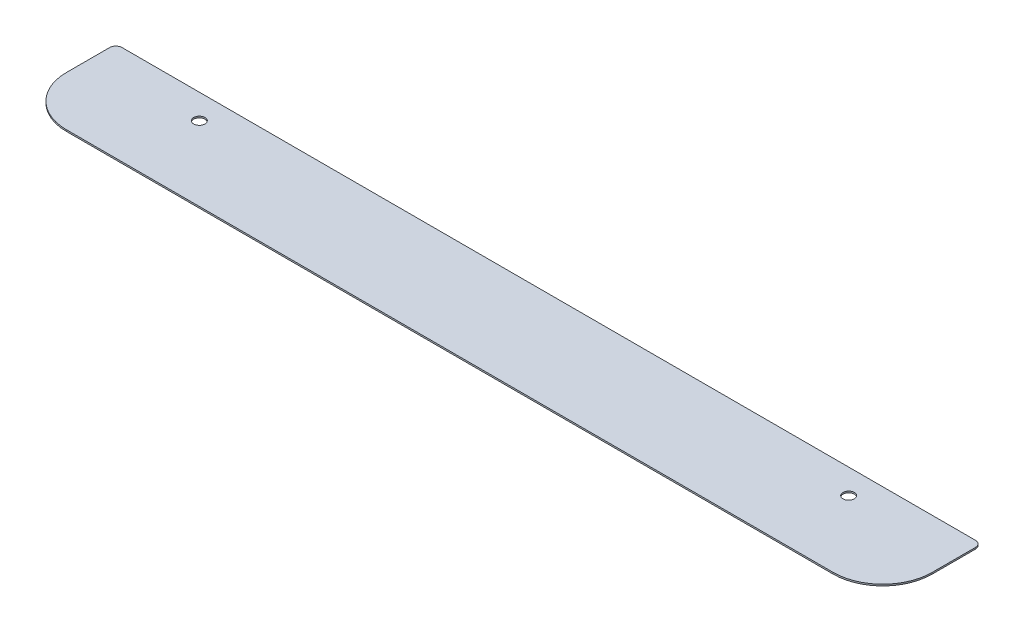
ISO-10303-21;
HEADER;
FILE_DESCRIPTION(('STEP AP214'),'2;1');
FILE_NAME('part.step','',(''),(''),'','','');
FILE_SCHEMA(('AUTOMOTIVE_DESIGN { 1 0 10303 214 1 1 1 1 }'));
ENDSEC;
DATA;
#1=APPLICATION_CONTEXT('core data for automotive mechanical design processes');
#2=APPLICATION_PROTOCOL_DEFINITION('international standard','automotive_design',2000,#1);
#3=PRODUCT_CONTEXT('',#1,'mechanical');
#4=PRODUCT('Part','Part','',(#3));
#5=PRODUCT_RELATED_PRODUCT_CATEGORY('part','',(#4));
#6=PRODUCT_DEFINITION_FORMATION('','',#4);
#7=PRODUCT_DEFINITION_CONTEXT('part definition',#1,'design');
#8=PRODUCT_DEFINITION('design','',#6,#7);
#9=PRODUCT_DEFINITION_SHAPE('','',#8);
#10=(LENGTH_UNIT() NAMED_UNIT(*) SI_UNIT(.MILLI.,.METRE.));
#11=(NAMED_UNIT(*) PLANE_ANGLE_UNIT() SI_UNIT($,.RADIAN.));
#12=(NAMED_UNIT(*) SI_UNIT($,.STERADIAN.) SOLID_ANGLE_UNIT());
#13=UNCERTAINTY_MEASURE_WITH_UNIT(LENGTH_MEASURE(1.E-05),#10,'distance_accuracy_value','');
#14=(GEOMETRIC_REPRESENTATION_CONTEXT(3) GLOBAL_UNCERTAINTY_ASSIGNED_CONTEXT((#13)) GLOBAL_UNIT_ASSIGNED_CONTEXT((#10,
#11,#12)) REPRESENTATION_CONTEXT('',''));
#15=CARTESIAN_POINT('',(0.,0.,0.));
#16=DIRECTION('',(0.,0.,1.));
#17=DIRECTION('',(1.,0.,0.));
#18=AXIS2_PLACEMENT_3D('',#15,#16,#17);
#19=CARTESIAN_POINT('',(222.25,0.79375,25.4));
#20=DIRECTION('',(-1.,0.,0.));
#21=DIRECTION('',(0.,0.,1.));
#22=AXIS2_PLACEMENT_3D('',#19,#20,#21);
#23=PLANE('',#22);
#24=DIRECTION('',(0.,0.,-1.));
#25=VECTOR('',#24,1.);
#26=CARTESIAN_POINT('',(222.25,0.,25.4));
#27=LINE('',#26,#25);
#28=CARTESIAN_POINT('',(222.25,0.,0.));
#29=VERTEX_POINT('',#28);
#30=CARTESIAN_POINT('',(222.25,0.,-22.225));
#31=VERTEX_POINT('',#30);
#32=EDGE_CURVE('E116',#29,#31,#27,.T.);
#33=ORIENTED_EDGE('',*,*,#32,.T.);
#34=DIRECTION('',(0.,-1.,0.));
#35=VECTOR('',#34,1.);
#36=CARTESIAN_POINT('',(222.25,0.79375,-22.225));
#37=LINE('',#36,#35);
#38=CARTESIAN_POINT('',(222.25,0.79375,-22.225));
#39=VERTEX_POINT('',#38);
#40=EDGE_CURVE('E11',#31,#39,#37,.F.);
#41=ORIENTED_EDGE('',*,*,#40,.T.);
#42=DIRECTION('',(0.,0.,-1.));
#43=VECTOR('',#42,1.);
#44=CARTESIAN_POINT('',(222.25,0.79375,25.4));
#45=LINE('',#44,#43);
#46=CARTESIAN_POINT('',(222.25,0.79375,0.));
#47=VERTEX_POINT('',#46);
#48=EDGE_CURVE('E117',#47,#39,#45,.T.);
#49=ORIENTED_EDGE('',*,*,#48,.F.);
#50=DIRECTION('',(0.,-1.,0.));
#51=VECTOR('',#50,1.);
#52=CARTESIAN_POINT('',(222.25,0.79375,0.));
#53=LINE('',#52,#51);
#54=EDGE_CURVE('E107',#47,#29,#53,.T.);
#55=ORIENTED_EDGE('',*,*,#54,.T.);
#56=EDGE_LOOP('',(#33,#41,#49,#55));
#57=FACE_BOUND('',#56,.T.);
#58=ADVANCED_FACE('F36',(#57),#23,.F.);
#59=CARTESIAN_POINT('',(-222.25,0.79375,-25.4));
#60=DIRECTION('',(0.,0.,1.));
#61=DIRECTION('',(1.,0.,0.));
#62=AXIS2_PLACEMENT_3D('',#59,#60,#61);
#63=PLANE('',#62);
#64=DIRECTION('',(-1.,0.,0.));
#65=VECTOR('',#64,1.);
#66=CARTESIAN_POINT('',(-222.25,0.,-25.4));
#67=LINE('',#66,#65);
#68=CARTESIAN_POINT('',(219.075,0.,-25.4));
#69=VERTEX_POINT('',#68);
#70=CARTESIAN_POINT('',(-219.075,0.,-25.4));
#71=VERTEX_POINT('',#70);
#72=EDGE_CURVE('E124',#69,#71,#67,.T.);
#73=ORIENTED_EDGE('',*,*,#72,.T.);
#74=DIRECTION('',(0.,-1.,0.));
#75=VECTOR('',#74,1.);
#76=CARTESIAN_POINT('',(-219.075,0.79375,-25.4));
#77=LINE('',#76,#75);
#78=CARTESIAN_POINT('',(-219.075,0.79375,-25.4));
#79=VERTEX_POINT('',#78);
#80=EDGE_CURVE('E57',#71,#79,#77,.F.);
#81=ORIENTED_EDGE('',*,*,#80,.T.);
#82=DIRECTION('',(-1.,0.,0.));
#83=VECTOR('',#82,1.);
#84=CARTESIAN_POINT('',(-222.25,0.79375,-25.4));
#85=LINE('',#84,#83);
#86=CARTESIAN_POINT('',(219.075,0.79375,-25.4));
#87=VERTEX_POINT('',#86);
#88=EDGE_CURVE('E166',#87,#79,#85,.T.);
#89=ORIENTED_EDGE('',*,*,#88,.F.);
#90=DIRECTION('',(0.,-1.,0.));
#91=VECTOR('',#90,1.);
#92=CARTESIAN_POINT('',(219.075,0.79375,-25.4));
#93=LINE('',#92,#91);
#94=EDGE_CURVE('E156',#87,#69,#93,.T.);
#95=ORIENTED_EDGE('',*,*,#94,.T.);
#96=EDGE_LOOP('',(#73,#81,#89,#95));
#97=FACE_BOUND('',#96,.T.);
#98=ADVANCED_FACE('F174',(#97),#63,.F.);
#99=CARTESIAN_POINT('',(-222.25,0.79375,25.4));
#100=DIRECTION('',(1.,0.,0.));
#101=DIRECTION('',(0.,0.,-1.));
#102=AXIS2_PLACEMENT_3D('',#99,#100,#101);
#103=PLANE('',#102);
#104=DIRECTION('',(0.,0.,1.));
#105=VECTOR('',#104,1.);
#106=CARTESIAN_POINT('',(-222.25,0.79375,25.4));
#107=LINE('',#106,#105);
#108=CARTESIAN_POINT('',(-222.25,0.79375,-22.225));
#109=VERTEX_POINT('',#108);
#110=CARTESIAN_POINT('',(-222.25,0.79375,0.));
#111=VERTEX_POINT('',#110);
#112=EDGE_CURVE('E165',#109,#111,#107,.T.);
#113=ORIENTED_EDGE('',*,*,#112,.F.);
#114=DIRECTION('',(0.,-1.,0.));
#115=VECTOR('',#114,1.);
#116=CARTESIAN_POINT('',(-222.25,0.79375,-22.225));
#117=LINE('',#116,#115);
#118=CARTESIAN_POINT('',(-222.25,0.,-22.225));
#119=VERTEX_POINT('',#118);
#120=EDGE_CURVE('E150',#109,#119,#117,.T.);
#121=ORIENTED_EDGE('',*,*,#120,.T.);
#122=DIRECTION('',(0.,0.,1.));
#123=VECTOR('',#122,1.);
#124=CARTESIAN_POINT('',(-222.25,0.,25.4));
#125=LINE('',#124,#123);
#126=CARTESIAN_POINT('',(-222.25,0.,0.));
#127=VERTEX_POINT('',#126);
#128=EDGE_CURVE('E127',#119,#127,#125,.T.);
#129=ORIENTED_EDGE('',*,*,#128,.T.);
#130=DIRECTION('',(0.,-1.,0.));
#131=VECTOR('',#130,1.);
#132=CARTESIAN_POINT('',(-222.25,0.79375,0.));
#133=LINE('',#132,#131);
#134=EDGE_CURVE('E147',#127,#111,#133,.F.);
#135=ORIENTED_EDGE('',*,*,#134,.T.);
#136=EDGE_LOOP('',(#113,#121,#129,#135));
#137=FACE_BOUND('',#136,.T.);
#138=ADVANCED_FACE('F170',(#137),#103,.F.);
#139=CARTESIAN_POINT('',(-222.25,0.79375,25.4));
#140=DIRECTION('',(0.,0.,-1.));
#141=DIRECTION('',(-1.,0.,0.));
#142=AXIS2_PLACEMENT_3D('',#139,#140,#141);
#143=PLANE('',#142);
#144=DIRECTION('',(1.,0.,0.));
#145=VECTOR('',#144,1.);
#146=CARTESIAN_POINT('',(-222.25,0.,25.4));
#147=LINE('',#146,#145);
#148=CARTESIAN_POINT('',(-196.85,0.,25.4));
#149=VERTEX_POINT('',#148);
#150=CARTESIAN_POINT('',(196.85,0.,25.4));
#151=VERTEX_POINT('',#150);
#152=EDGE_CURVE('E136',#149,#151,#147,.T.);
#153=ORIENTED_EDGE('',*,*,#152,.T.);
#154=DIRECTION('',(0.,-1.,0.));
#155=VECTOR('',#154,1.);
#156=CARTESIAN_POINT('',(196.85,0.79375,25.4));
#157=LINE('',#156,#155);
#158=CARTESIAN_POINT('',(196.85,0.79375,25.4));
#159=VERTEX_POINT('',#158);
#160=EDGE_CURVE('E108',#151,#159,#157,.F.);
#161=ORIENTED_EDGE('',*,*,#160,.T.);
#162=DIRECTION('',(1.,0.,0.));
#163=VECTOR('',#162,1.);
#164=CARTESIAN_POINT('',(-222.25,0.79375,25.4));
#165=LINE('',#164,#163);
#166=CARTESIAN_POINT('',(-196.85,0.79375,25.4));
#167=VERTEX_POINT('',#166);
#168=EDGE_CURVE('E118',#167,#159,#165,.T.);
#169=ORIENTED_EDGE('',*,*,#168,.F.);
#170=DIRECTION('',(0.,-1.,0.));
#171=VECTOR('',#170,1.);
#172=CARTESIAN_POINT('',(-196.85,0.79375,25.4));
#173=LINE('',#172,#171);
#174=EDGE_CURVE('E113',#167,#149,#173,.T.);
#175=ORIENTED_EDGE('',*,*,#174,.T.);
#176=EDGE_LOOP('',(#153,#161,#169,#175));
#177=FACE_BOUND('',#176,.T.);
#178=ADVANCED_FACE('F195',(#177),#143,.F.);
#179=CARTESIAN_POINT('',(0.,0.79375,0.));
#180=DIRECTION('',(0.,-1.,0.));
#181=DIRECTION('',(0.,0.,-1.));
#182=AXIS2_PLACEMENT_3D('',#179,#180,#181);
#183=PLANE('',#182);
#184=CARTESIAN_POINT('',(-166.6875,0.79375,-12.7));
#185=DIRECTION('',(0.,1.,0.));
#186=DIRECTION('',(0.,0.,1.));
#187=AXIS2_PLACEMENT_3D('',#184,#185,#186);
#188=CIRCLE('',#187,2.8956);
#189=CARTESIAN_POINT('',(-166.6875,0.79375,-9.80439999999999));
#190=VERTEX_POINT('',#189);
#191=EDGE_CURVE('E187',#190,#190,#188,.T.);
#192=ORIENTED_EDGE('',*,*,#191,.F.);
#193=EDGE_LOOP('',(#192));
#194=FACE_BOUND('',#193,.T.);
#195=CARTESIAN_POINT('',(166.6875,0.79375,-12.7));
#196=DIRECTION('',(0.,1.,0.));
#197=DIRECTION('',(0.,0.,1.));
#198=AXIS2_PLACEMENT_3D('',#195,#196,#197);
#199=CIRCLE('',#198,2.8956);
#200=CARTESIAN_POINT('',(166.6875,0.79375,-9.80439999999999));
#201=VERTEX_POINT('',#200);
#202=EDGE_CURVE('E130',#201,#201,#199,.T.);
#203=ORIENTED_EDGE('',*,*,#202,.F.);
#204=EDGE_LOOP('',(#203));
#205=FACE_BOUND('',#204,.T.);
#206=ORIENTED_EDGE('',*,*,#88,.T.);
#207=CARTESIAN_POINT('',(-219.075,0.79375,-22.225));
#208=DIRECTION('',(0.,-1.,0.));
#209=DIRECTION('',(0.,0.,-1.));
#210=AXIS2_PLACEMENT_3D('',#207,#208,#209);
#211=CIRCLE('',#210,3.175);
#212=EDGE_CURVE('E44',#79,#109,#211,.F.);
#213=ORIENTED_EDGE('',*,*,#212,.T.);
#214=ORIENTED_EDGE('',*,*,#112,.T.);
#215=CARTESIAN_POINT('',(-196.85,0.79375,0.));
#216=DIRECTION('',(0.,-1.,0.));
#217=DIRECTION('',(0.,0.,-1.));
#218=AXIS2_PLACEMENT_3D('',#215,#216,#217);
#219=CIRCLE('',#218,25.4);
#220=EDGE_CURVE('E143',#111,#167,#219,.F.);
#221=ORIENTED_EDGE('',*,*,#220,.T.);
#222=ORIENTED_EDGE('',*,*,#168,.T.);
#223=CARTESIAN_POINT('',(196.85,0.79375,0.));
#224=DIRECTION('',(0.,-1.,0.));
#225=DIRECTION('',(0.,0.,-1.));
#226=AXIS2_PLACEMENT_3D('',#223,#224,#225);
#227=CIRCLE('',#226,25.4);
#228=EDGE_CURVE('E145',#159,#47,#227,.F.);
#229=ORIENTED_EDGE('',*,*,#228,.T.);
#230=ORIENTED_EDGE('',*,*,#48,.T.);
#231=CARTESIAN_POINT('',(219.075,0.79375,-22.225));
#232=DIRECTION('',(0.,-1.,0.));
#233=DIRECTION('',(0.,0.,-1.));
#234=AXIS2_PLACEMENT_3D('',#231,#232,#233);
#235=CIRCLE('',#234,3.175);
#236=EDGE_CURVE('E160',#39,#87,#235,.F.);
#237=ORIENTED_EDGE('',*,*,#236,.T.);
#238=EDGE_LOOP('',(#206,#213,#214,#221,#222,#229,#230,#237));
#239=FACE_BOUND('',#238,.T.);
#240=ADVANCED_FACE('F164',(#194,#205,#239),#183,.F.);
#241=CARTESIAN_POINT('',(0.,0.,0.));
#242=DIRECTION('',(0.,-1.,0.));
#243=DIRECTION('',(0.,0.,-1.));
#244=AXIS2_PLACEMENT_3D('',#241,#242,#243);
#245=PLANE('',#244);
#246=CARTESIAN_POINT('',(-166.6875,0.,-12.7));
#247=DIRECTION('',(0.,1.,0.));
#248=DIRECTION('',(0.,0.,1.));
#249=AXIS2_PLACEMENT_3D('',#246,#247,#248);
#250=CIRCLE('',#249,2.8956);
#251=CARTESIAN_POINT('',(-166.6875,0.,-9.80439999999999));
#252=VERTEX_POINT('',#251);
#253=EDGE_CURVE('E184',#252,#252,#250,.T.);
#254=ORIENTED_EDGE('',*,*,#253,.T.);
#255=EDGE_LOOP('',(#254));
#256=FACE_BOUND('',#255,.T.);
#257=CARTESIAN_POINT('',(166.6875,0.,-12.7));
#258=DIRECTION('',(0.,1.,0.));
#259=DIRECTION('',(0.,0.,1.));
#260=AXIS2_PLACEMENT_3D('',#257,#258,#259);
#261=CIRCLE('',#260,2.8956);
#262=CARTESIAN_POINT('',(166.6875,0.,-9.80439999999999));
#263=VERTEX_POINT('',#262);
#264=EDGE_CURVE('E125',#263,#263,#261,.T.);
#265=ORIENTED_EDGE('',*,*,#264,.T.);
#266=EDGE_LOOP('',(#265));
#267=FACE_BOUND('',#266,.T.);
#268=ORIENTED_EDGE('',*,*,#128,.F.);
#269=CARTESIAN_POINT('',(-219.075,0.,-22.225));
#270=DIRECTION('',(0.,-1.,0.));
#271=DIRECTION('',(0.,0.,-1.));
#272=AXIS2_PLACEMENT_3D('',#269,#270,#271);
#273=CIRCLE('',#272,3.175);
#274=EDGE_CURVE('E154',#119,#71,#273,.T.);
#275=ORIENTED_EDGE('',*,*,#274,.T.);
#276=ORIENTED_EDGE('',*,*,#72,.F.);
#277=CARTESIAN_POINT('',(219.075,0.,-22.225));
#278=DIRECTION('',(0.,-1.,0.));
#279=DIRECTION('',(0.,0.,-1.));
#280=AXIS2_PLACEMENT_3D('',#277,#278,#279);
#281=CIRCLE('',#280,3.175);
#282=EDGE_CURVE('E123',#69,#31,#281,.T.);
#283=ORIENTED_EDGE('',*,*,#282,.T.);
#284=ORIENTED_EDGE('',*,*,#32,.F.);
#285=CARTESIAN_POINT('',(196.85,0.,0.));
#286=DIRECTION('',(0.,-1.,0.));
#287=DIRECTION('',(0.,0.,-1.));
#288=AXIS2_PLACEMENT_3D('',#285,#286,#287);
#289=CIRCLE('',#288,25.4);
#290=EDGE_CURVE('E103',#29,#151,#289,.T.);
#291=ORIENTED_EDGE('',*,*,#290,.T.);
#292=ORIENTED_EDGE('',*,*,#152,.F.);
#293=CARTESIAN_POINT('',(-196.85,0.,0.));
#294=DIRECTION('',(0.,-1.,0.));
#295=DIRECTION('',(0.,0.,-1.));
#296=AXIS2_PLACEMENT_3D('',#293,#294,#295);
#297=CIRCLE('',#296,25.4);
#298=EDGE_CURVE('E114',#149,#127,#297,.T.);
#299=ORIENTED_EDGE('',*,*,#298,.T.);
#300=EDGE_LOOP('',(#268,#275,#276,#283,#284,#291,#292,#299));
#301=FACE_BOUND('',#300,.T.);
#302=ADVANCED_FACE('F121',(#256,#267,#301),#245,.T.);
#303=CARTESIAN_POINT('',(196.85,0.79375,0.));
#304=DIRECTION('',(0.,-1.,0.));
#305=DIRECTION('',(0.,0.,-1.));
#306=AXIS2_PLACEMENT_3D('',#303,#304,#305);
#307=CYLINDRICAL_SURFACE('',#306,25.4);
#308=ORIENTED_EDGE('',*,*,#228,.F.);
#309=ORIENTED_EDGE('',*,*,#160,.F.);
#310=ORIENTED_EDGE('',*,*,#290,.F.);
#311=ORIENTED_EDGE('',*,*,#54,.F.);
#312=EDGE_LOOP('',(#308,#309,#310,#311));
#313=FACE_BOUND('',#312,.T.);
#314=ADVANCED_FACE('F106',(#313),#307,.T.);
#315=CARTESIAN_POINT('',(-196.85,0.79375,0.));
#316=DIRECTION('',(0.,-1.,0.));
#317=DIRECTION('',(0.,0.,-1.));
#318=AXIS2_PLACEMENT_3D('',#315,#316,#317);
#319=CYLINDRICAL_SURFACE('',#318,25.4);
#320=ORIENTED_EDGE('',*,*,#220,.F.);
#321=ORIENTED_EDGE('',*,*,#134,.F.);
#322=ORIENTED_EDGE('',*,*,#298,.F.);
#323=ORIENTED_EDGE('',*,*,#174,.F.);
#324=EDGE_LOOP('',(#320,#321,#322,#323));
#325=FACE_BOUND('',#324,.T.);
#326=ADVANCED_FACE('F220',(#325),#319,.T.);
#327=CARTESIAN_POINT('',(-219.075,0.79375,-22.225));
#328=DIRECTION('',(0.,-1.,0.));
#329=DIRECTION('',(0.,0.,-1.));
#330=AXIS2_PLACEMENT_3D('',#327,#328,#329);
#331=CYLINDRICAL_SURFACE('',#330,3.175);
#332=ORIENTED_EDGE('',*,*,#212,.F.);
#333=ORIENTED_EDGE('',*,*,#80,.F.);
#334=ORIENTED_EDGE('',*,*,#274,.F.);
#335=ORIENTED_EDGE('',*,*,#120,.F.);
#336=EDGE_LOOP('',(#332,#333,#334,#335));
#337=FACE_BOUND('',#336,.T.);
#338=ADVANCED_FACE('F173',(#337),#331,.T.);
#339=CARTESIAN_POINT('',(219.075,0.79375,-22.225));
#340=DIRECTION('',(0.,-1.,0.));
#341=DIRECTION('',(0.,0.,-1.));
#342=AXIS2_PLACEMENT_3D('',#339,#340,#341);
#343=CYLINDRICAL_SURFACE('',#342,3.175);
#344=ORIENTED_EDGE('',*,*,#236,.F.);
#345=ORIENTED_EDGE('',*,*,#40,.F.);
#346=ORIENTED_EDGE('',*,*,#282,.F.);
#347=ORIENTED_EDGE('',*,*,#94,.F.);
#348=EDGE_LOOP('',(#344,#345,#346,#347));
#349=FACE_BOUND('',#348,.T.);
#350=ADVANCED_FACE('F38',(#349),#343,.T.);
#351=CARTESIAN_POINT('',(166.6875,0.79375,-12.7));
#352=DIRECTION('',(0.,1.,0.));
#353=DIRECTION('',(0.,0.,1.));
#354=AXIS2_PLACEMENT_3D('',#351,#352,#353);
#355=CYLINDRICAL_SURFACE('',#354,2.8956);
#356=ORIENTED_EDGE('',*,*,#264,.F.);
#357=EDGE_LOOP('',(#356));
#358=FACE_BOUND('',#357,.T.);
#359=ORIENTED_EDGE('',*,*,#202,.T.);
#360=EDGE_LOOP('',(#359));
#361=FACE_BOUND('',#360,.T.);
#362=ADVANCED_FACE('F199',(#358,#361),#355,.F.);
#363=CARTESIAN_POINT('',(-166.6875,0.79375,-12.7));
#364=DIRECTION('',(0.,1.,0.));
#365=DIRECTION('',(0.,0.,1.));
#366=AXIS2_PLACEMENT_3D('',#363,#364,#365);
#367=CYLINDRICAL_SURFACE('',#366,2.8956);
#368=ORIENTED_EDGE('',*,*,#253,.F.);
#369=EDGE_LOOP('',(#368));
#370=FACE_BOUND('',#369,.T.);
#371=ORIENTED_EDGE('',*,*,#191,.T.);
#372=EDGE_LOOP('',(#371));
#373=FACE_BOUND('',#372,.T.);
#374=ADVANCED_FACE('F191',(#370,#373),#367,.F.);
#375=CLOSED_SHELL('',(#58,#98,#138,#178,#240,#302,#314,#326,#338,#350,#362,#374));
#376=MANIFOLD_SOLID_BREP('B2',#375);
#377=ADVANCED_BREP_SHAPE_REPRESENTATION('',(#18,#376),#14);
#378=SHAPE_DEFINITION_REPRESENTATION(#9,#377);
ENDSEC;
END-ISO-10303-21;
